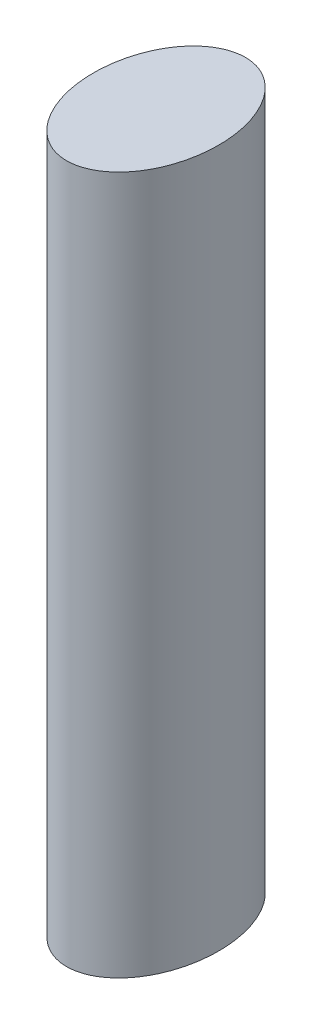
ISO-10303-21;
HEADER;
FILE_DESCRIPTION(('STEP AP214'),'2;1');
FILE_NAME('part.step','',(''),(''),'','','');
FILE_SCHEMA(('AUTOMOTIVE_DESIGN { 1 0 10303 214 1 1 1 1 }'));
ENDSEC;
DATA;
#1=APPLICATION_CONTEXT('core data for automotive mechanical design processes');
#2=APPLICATION_PROTOCOL_DEFINITION('international standard','automotive_design',2000,#1);
#3=PRODUCT_CONTEXT('',#1,'mechanical');
#4=PRODUCT('Part','Part','',(#3));
#5=PRODUCT_RELATED_PRODUCT_CATEGORY('part','',(#4));
#6=PRODUCT_DEFINITION_FORMATION('','',#4);
#7=PRODUCT_DEFINITION_CONTEXT('part definition',#1,'design');
#8=PRODUCT_DEFINITION('design','',#6,#7);
#9=PRODUCT_DEFINITION_SHAPE('','',#8);
#10=(LENGTH_UNIT() NAMED_UNIT(*) SI_UNIT(.MILLI.,.METRE.));
#11=(NAMED_UNIT(*) PLANE_ANGLE_UNIT() SI_UNIT($,.RADIAN.));
#12=(NAMED_UNIT(*) SI_UNIT($,.STERADIAN.) SOLID_ANGLE_UNIT());
#13=UNCERTAINTY_MEASURE_WITH_UNIT(LENGTH_MEASURE(1.E-05),#10,'distance_accuracy_value','');
#14=(GEOMETRIC_REPRESENTATION_CONTEXT(3) GLOBAL_UNCERTAINTY_ASSIGNED_CONTEXT((#13)) GLOBAL_UNIT_ASSIGNED_CONTEXT((#10,
#11,#12)) REPRESENTATION_CONTEXT('',''));
#15=CARTESIAN_POINT('',(0.,0.,0.));
#16=DIRECTION('',(0.,0.,1.));
#17=DIRECTION('',(1.,0.,0.));
#18=AXIS2_PLACEMENT_3D('',#15,#16,#17);
#19=CARTESIAN_POINT('',(0.,195.,0.));
#20=DIRECTION('',(0.,1.,0.));
#21=DIRECTION('',(0.,0.,-1.));
#22=AXIS2_PLACEMENT_3D('',#19,#20,#21);
#23=ELLIPSE('',#22,25.,17.5);
#24=DIRECTION('',(0.,-1.,0.));
#25=VECTOR('',#24,1.);
#26=SURFACE_OF_LINEAR_EXTRUSION('',#23,#25);
#27=CARTESIAN_POINT('',(0.,195.,-25.));
#28=VERTEX_POINT('',#27);
#29=EDGE_CURVE('E10',#28,#28,#23,.T.);
#30=ORIENTED_EDGE('',*,*,#29,.F.);
#31=EDGE_LOOP('',(#30));
#32=FACE_BOUND('',#31,.T.);
#33=CARTESIAN_POINT('',(0.,0.,0.));
#34=DIRECTION('',(0.,1.,0.));
#35=DIRECTION('',(0.,0.,-1.));
#36=AXIS2_PLACEMENT_3D('',#33,#34,#35);
#37=ELLIPSE('',#36,25.,17.5);
#38=CARTESIAN_POINT('',(0.,0.,-25.));
#39=VERTEX_POINT('',#38);
#40=EDGE_CURVE('E41',#39,#39,#37,.T.);
#41=ORIENTED_EDGE('',*,*,#40,.T.);
#42=EDGE_LOOP('',(#41));
#43=FACE_BOUND('',#42,.T.);
#44=ADVANCED_FACE('F37',(#32,#43),#26,.F.);
#45=CARTESIAN_POINT('',(0.,195.,0.));
#46=DIRECTION('',(0.,1.,0.));
#47=DIRECTION('',(0.,0.,1.));
#48=AXIS2_PLACEMENT_3D('',#45,#46,#47);
#49=PLANE('',#48);
#50=ORIENTED_EDGE('',*,*,#29,.T.);
#51=EDGE_LOOP('',(#50));
#52=FACE_BOUND('',#51,.T.);
#53=ADVANCED_FACE('F55',(#52),#49,.T.);
#54=CARTESIAN_POINT('',(0.,0.,0.));
#55=DIRECTION('',(0.,1.,0.));
#56=DIRECTION('',(0.,0.,1.));
#57=AXIS2_PLACEMENT_3D('',#54,#55,#56);
#58=PLANE('',#57);
#59=ORIENTED_EDGE('',*,*,#40,.F.);
#60=EDGE_LOOP('',(#59));
#61=FACE_BOUND('',#60,.T.);
#62=ADVANCED_FACE('F53',(#61),#58,.F.);
#63=CLOSED_SHELL('',(#44,#53,#62));
#64=MANIFOLD_SOLID_BREP('B2',#63);
#65=ADVANCED_BREP_SHAPE_REPRESENTATION('',(#18,#64),#14);
#66=SHAPE_DEFINITION_REPRESENTATION(#9,#65);
ENDSEC;
END-ISO-10303-21;
